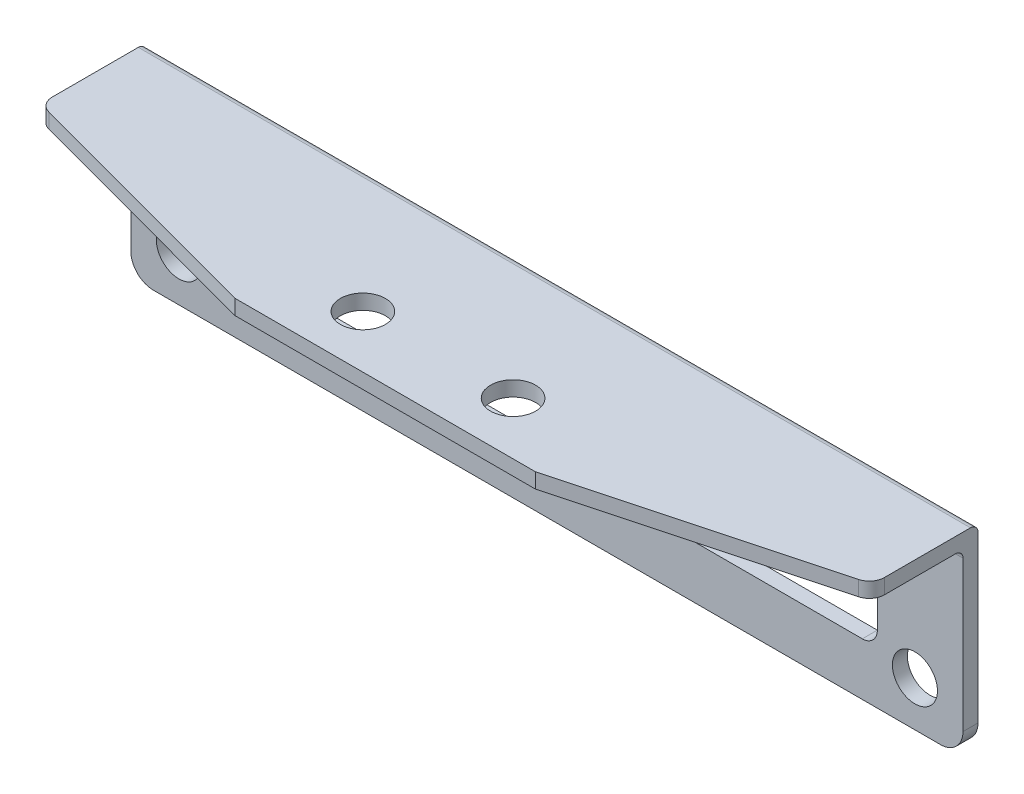
ISO-10303-21;
HEADER;
FILE_DESCRIPTION(('STEP AP214'),'2;1');
FILE_NAME('part.step','',(''),(''),'','','');
FILE_SCHEMA(('AUTOMOTIVE_DESIGN { 1 0 10303 214 1 1 1 1 }'));
ENDSEC;
DATA;
#1=APPLICATION_CONTEXT('core data for automotive mechanical design processes');
#2=APPLICATION_PROTOCOL_DEFINITION('international standard','automotive_design',2000,#1);
#3=PRODUCT_CONTEXT('',#1,'mechanical');
#4=PRODUCT('Part','Part','',(#3));
#5=PRODUCT_RELATED_PRODUCT_CATEGORY('part','',(#4));
#6=PRODUCT_DEFINITION_FORMATION('','',#4);
#7=PRODUCT_DEFINITION_CONTEXT('part definition',#1,'design');
#8=PRODUCT_DEFINITION('design','',#6,#7);
#9=PRODUCT_DEFINITION_SHAPE('','',#8);
#10=(LENGTH_UNIT() NAMED_UNIT(*) SI_UNIT(.MILLI.,.METRE.));
#11=(NAMED_UNIT(*) PLANE_ANGLE_UNIT() SI_UNIT($,.RADIAN.));
#12=(NAMED_UNIT(*) SI_UNIT($,.STERADIAN.) SOLID_ANGLE_UNIT());
#13=UNCERTAINTY_MEASURE_WITH_UNIT(LENGTH_MEASURE(1.E-05),#10,'distance_accuracy_value','');
#14=(GEOMETRIC_REPRESENTATION_CONTEXT(3) GLOBAL_UNCERTAINTY_ASSIGNED_CONTEXT((#13)) GLOBAL_UNIT_ASSIGNED_CONTEXT((#10,
#11,#12)) REPRESENTATION_CONTEXT('',''));
#15=CARTESIAN_POINT('',(0.,0.,0.));
#16=DIRECTION('',(0.,0.,1.));
#17=DIRECTION('',(1.,0.,0.));
#18=AXIS2_PLACEMENT_3D('',#15,#16,#17);
#19=CARTESIAN_POINT('',(0.,0.,1.));
#20=DIRECTION('',(0.,0.,1.));
#21=DIRECTION('',(1.,0.,0.));
#22=AXIS2_PLACEMENT_3D('',#19,#20,#21);
#23=PLANE('',#22);
#24=DIRECTION('',(1.,0.,0.));
#25=VECTOR('',#24,1.);
#26=CARTESIAN_POINT('',(-27.7,0.,1.));
#27=LINE('',#26,#25);
#28=CARTESIAN_POINT('',(-26.2,0.,1.));
#29=VERTEX_POINT('',#28);
#30=CARTESIAN_POINT('',(26.2,0.,1.));
#31=VERTEX_POINT('',#30);
#32=EDGE_CURVE('E251',#29,#31,#27,.T.);
#33=ORIENTED_EDGE('',*,*,#32,.T.);
#34=CARTESIAN_POINT('',(26.2,1.5,1.));
#35=DIRECTION('',(0.,0.,1.));
#36=DIRECTION('',(1.,0.,0.));
#37=AXIS2_PLACEMENT_3D('',#34,#35,#36);
#38=CIRCLE('',#37,1.5);
#39=CARTESIAN_POINT('',(27.7,1.5,1.));
#40=VERTEX_POINT('',#39);
#41=EDGE_CURVE('E366',#31,#40,#38,.T.);
#42=ORIENTED_EDGE('',*,*,#41,.T.);
#43=DIRECTION('',(0.,1.,0.));
#44=VECTOR('',#43,1.);
#45=CARTESIAN_POINT('',(27.7,0.,1.));
#46=LINE('',#45,#44);
#47=CARTESIAN_POINT('',(27.7,11.5,1.));
#48=VERTEX_POINT('',#47);
#49=EDGE_CURVE('E317',#40,#48,#46,.T.);
#50=ORIENTED_EDGE('',*,*,#49,.T.);
#51=DIRECTION('',(1.,0.,0.));
#52=VECTOR('',#51,1.);
#53=CARTESIAN_POINT('',(0.,11.5,1.));
#54=LINE('',#53,#52);
#55=CARTESIAN_POINT('',(-27.7,11.5,1.));
#56=VERTEX_POINT('',#55);
#57=EDGE_CURVE('E272',#48,#56,#54,.F.);
#58=ORIENTED_EDGE('',*,*,#57,.T.);
#59=DIRECTION('',(0.,-1.,0.));
#60=VECTOR('',#59,1.);
#61=CARTESIAN_POINT('',(-27.7,13.,1.));
#62=LINE('',#61,#60);
#63=CARTESIAN_POINT('',(-27.7,1.5,1.));
#64=VERTEX_POINT('',#63);
#65=EDGE_CURVE('E254',#56,#64,#62,.T.);
#66=ORIENTED_EDGE('',*,*,#65,.T.);
#67=CARTESIAN_POINT('',(-26.2,1.5,1.));
#68=DIRECTION('',(0.,0.,1.));
#69=DIRECTION('',(1.,0.,0.));
#70=AXIS2_PLACEMENT_3D('',#67,#68,#69);
#71=CIRCLE('',#70,1.5);
#72=EDGE_CURVE('E379',#64,#29,#71,.T.);
#73=ORIENTED_EDGE('',*,*,#72,.T.);
#74=EDGE_LOOP('',(#33,#42,#50,#58,#66,#73));
#75=FACE_BOUND('',#74,.T.);
#76=CARTESIAN_POINT('',(-24.5,3.,1.));
#77=DIRECTION('',(0.,0.,1.));
#78=DIRECTION('',(1.,0.,0.));
#79=AXIS2_PLACEMENT_3D('',#76,#77,#78);
#80=CIRCLE('',#79,1.5);
#81=CARTESIAN_POINT('',(-23.,3.,1.));
#82=VERTEX_POINT('',#81);
#83=EDGE_CURVE('E219',#82,#82,#80,.T.);
#84=ORIENTED_EDGE('',*,*,#83,.F.);
#85=EDGE_LOOP('',(#84));
#86=FACE_BOUND('',#85,.T.);
#87=DIRECTION('',(-1.,0.,0.));
#88=VECTOR('',#87,1.);
#89=CARTESIAN_POINT('',(-22.,8.3,1.));
#90=LINE('',#89,#88);
#91=CARTESIAN_POINT('',(21.,8.3,1.));
#92=VERTEX_POINT('',#91);
#93=CARTESIAN_POINT('',(-21.,8.3,1.));
#94=VERTEX_POINT('',#93);
#95=EDGE_CURVE('E228',#92,#94,#90,.T.);
#96=ORIENTED_EDGE('',*,*,#95,.F.);
#97=CARTESIAN_POINT('',(21.,7.3,1.));
#98=DIRECTION('',(0.,0.,1.));
#99=DIRECTION('',(1.,0.,0.));
#100=AXIS2_PLACEMENT_3D('',#97,#98,#99);
#101=CIRCLE('',#100,1.);
#102=CARTESIAN_POINT('',(22.,7.3,1.));
#103=VERTEX_POINT('',#102);
#104=EDGE_CURVE('E306',#92,#103,#101,.F.);
#105=ORIENTED_EDGE('',*,*,#104,.T.);
#106=DIRECTION('',(0.,1.,0.));
#107=VECTOR('',#106,1.);
#108=CARTESIAN_POINT('',(22.,8.3,1.));
#109=LINE('',#108,#107);
#110=CARTESIAN_POINT('',(22.,4.5,1.));
#111=VERTEX_POINT('',#110);
#112=EDGE_CURVE('E225',#111,#103,#109,.T.);
#113=ORIENTED_EDGE('',*,*,#112,.F.);
#114=CARTESIAN_POINT('',(21.,4.5,1.));
#115=DIRECTION('',(0.,0.,1.));
#116=DIRECTION('',(1.,0.,0.));
#117=AXIS2_PLACEMENT_3D('',#114,#115,#116);
#118=CIRCLE('',#117,1.);
#119=CARTESIAN_POINT('',(21.,3.5,1.));
#120=VERTEX_POINT('',#119);
#121=EDGE_CURVE('E302',#111,#120,#118,.F.);
#122=ORIENTED_EDGE('',*,*,#121,.T.);
#123=DIRECTION('',(1.,0.,0.));
#124=VECTOR('',#123,1.);
#125=CARTESIAN_POINT('',(-22.,3.5,1.));
#126=LINE('',#125,#124);
#127=CARTESIAN_POINT('',(-21.,3.5,1.));
#128=VERTEX_POINT('',#127);
#129=EDGE_CURVE('E235',#128,#120,#126,.T.);
#130=ORIENTED_EDGE('',*,*,#129,.F.);
#131=CARTESIAN_POINT('',(-21.,4.5,1.));
#132=DIRECTION('',(0.,0.,1.));
#133=DIRECTION('',(1.,0.,0.));
#134=AXIS2_PLACEMENT_3D('',#131,#132,#133);
#135=CIRCLE('',#134,1.);
#136=CARTESIAN_POINT('',(-22.,4.5,1.));
#137=VERTEX_POINT('',#136);
#138=EDGE_CURVE('E310',#128,#137,#135,.F.);
#139=ORIENTED_EDGE('',*,*,#138,.T.);
#140=DIRECTION('',(0.,-1.,0.));
#141=VECTOR('',#140,1.);
#142=CARTESIAN_POINT('',(-22.,8.3,1.));
#143=LINE('',#142,#141);
#144=CARTESIAN_POINT('',(-22.,7.3,1.));
#145=VERTEX_POINT('',#144);
#146=EDGE_CURVE('E232',#145,#137,#143,.T.);
#147=ORIENTED_EDGE('',*,*,#146,.F.);
#148=CARTESIAN_POINT('',(-21.,7.3,1.));
#149=DIRECTION('',(0.,0.,1.));
#150=DIRECTION('',(1.,0.,0.));
#151=AXIS2_PLACEMENT_3D('',#148,#149,#150);
#152=CIRCLE('',#151,1.);
#153=EDGE_CURVE('E314',#145,#94,#152,.F.);
#154=ORIENTED_EDGE('',*,*,#153,.T.);
#155=EDGE_LOOP('',(#96,#105,#113,#122,#130,#139,#147,#154));
#156=FACE_BOUND('',#155,.T.);
#157=CARTESIAN_POINT('',(24.5,3.,1.));
#158=DIRECTION('',(0.,0.,1.));
#159=DIRECTION('',(1.,0.,0.));
#160=AXIS2_PLACEMENT_3D('',#157,#158,#159);
#161=CIRCLE('',#160,1.5);
#162=CARTESIAN_POINT('',(26.,3.,1.));
#163=VERTEX_POINT('',#162);
#164=EDGE_CURVE('E212',#163,#163,#161,.T.);
#165=ORIENTED_EDGE('',*,*,#164,.F.);
#166=EDGE_LOOP('',(#165));
#167=FACE_BOUND('',#166,.T.);
#168=ADVANCED_FACE('F34',(#75,#86,#156,#167),#23,.T.);
#169=CARTESIAN_POINT('',(0.,0.,0.));
#170=DIRECTION('',(0.,0.,1.));
#171=DIRECTION('',(1.,0.,0.));
#172=AXIS2_PLACEMENT_3D('',#169,#170,#171);
#173=PLANE('',#172);
#174=CARTESIAN_POINT('',(-24.5,3.,0.));
#175=DIRECTION('',(0.,0.,1.));
#176=DIRECTION('',(1.,0.,0.));
#177=AXIS2_PLACEMENT_3D('',#174,#175,#176);
#178=CIRCLE('',#177,1.5);
#179=CARTESIAN_POINT('',(-23.,3.,0.));
#180=VERTEX_POINT('',#179);
#181=EDGE_CURVE('E215',#180,#180,#178,.T.);
#182=ORIENTED_EDGE('',*,*,#181,.T.);
#183=EDGE_LOOP('',(#182));
#184=FACE_BOUND('',#183,.T.);
#185=DIRECTION('',(0.,1.,0.));
#186=VECTOR('',#185,1.);
#187=CARTESIAN_POINT('',(27.7,0.,0.));
#188=LINE('',#187,#186);
#189=CARTESIAN_POINT('',(27.7,1.5,0.));
#190=VERTEX_POINT('',#189);
#191=CARTESIAN_POINT('',(27.7,12.5,0.));
#192=VERTEX_POINT('',#191);
#193=EDGE_CURVE('E258',#190,#192,#188,.T.);
#194=ORIENTED_EDGE('',*,*,#193,.F.);
#195=CARTESIAN_POINT('',(26.2,1.5,0.));
#196=DIRECTION('',(0.,0.,1.));
#197=DIRECTION('',(1.,0.,0.));
#198=AXIS2_PLACEMENT_3D('',#195,#196,#197);
#199=CIRCLE('',#198,1.5);
#200=CARTESIAN_POINT('',(26.2,0.,0.));
#201=VERTEX_POINT('',#200);
#202=EDGE_CURVE('E367',#190,#201,#199,.F.);
#203=ORIENTED_EDGE('',*,*,#202,.T.);
#204=DIRECTION('',(1.,0.,0.));
#205=VECTOR('',#204,1.);
#206=CARTESIAN_POINT('',(-27.7,0.,0.));
#207=LINE('',#206,#205);
#208=CARTESIAN_POINT('',(-26.2,0.,0.));
#209=VERTEX_POINT('',#208);
#210=EDGE_CURVE('E325',#209,#201,#207,.T.);
#211=ORIENTED_EDGE('',*,*,#210,.F.);
#212=CARTESIAN_POINT('',(-26.2,1.5,0.));
#213=DIRECTION('',(0.,0.,1.));
#214=DIRECTION('',(1.,0.,0.));
#215=AXIS2_PLACEMENT_3D('',#212,#213,#214);
#216=CIRCLE('',#215,1.5);
#217=CARTESIAN_POINT('',(-27.7,1.5,0.));
#218=VERTEX_POINT('',#217);
#219=EDGE_CURVE('E368',#209,#218,#216,.F.);
#220=ORIENTED_EDGE('',*,*,#219,.T.);
#221=DIRECTION('',(0.,-1.,0.));
#222=VECTOR('',#221,1.);
#223=CARTESIAN_POINT('',(-27.7,13.,0.));
#224=LINE('',#223,#222);
#225=CARTESIAN_POINT('',(-27.7,12.5,0.));
#226=VERTEX_POINT('',#225);
#227=EDGE_CURVE('E238',#226,#218,#224,.T.);
#228=ORIENTED_EDGE('',*,*,#227,.F.);
#229=DIRECTION('',(-1.,0.,0.));
#230=VECTOR('',#229,1.);
#231=CARTESIAN_POINT('',(0.,12.5,0.));
#232=LINE('',#231,#230);
#233=EDGE_CURVE('E263',#226,#192,#232,.F.);
#234=ORIENTED_EDGE('',*,*,#233,.T.);
#235=EDGE_LOOP('',(#194,#203,#211,#220,#228,#234));
#236=FACE_BOUND('',#235,.T.);
#237=DIRECTION('',(1.,0.,0.));
#238=VECTOR('',#237,1.);
#239=CARTESIAN_POINT('',(-22.,3.5,0.));
#240=LINE('',#239,#238);
#241=CARTESIAN_POINT('',(-21.,3.5,0.));
#242=VERTEX_POINT('',#241);
#243=CARTESIAN_POINT('',(21.,3.5,0.));
#244=VERTEX_POINT('',#243);
#245=EDGE_CURVE('E229',#242,#244,#240,.T.);
#246=ORIENTED_EDGE('',*,*,#245,.T.);
#247=CARTESIAN_POINT('',(21.,4.5,0.));
#248=DIRECTION('',(0.,0.,1.));
#249=DIRECTION('',(1.,0.,0.));
#250=AXIS2_PLACEMENT_3D('',#247,#248,#249);
#251=CIRCLE('',#250,1.);
#252=CARTESIAN_POINT('',(22.,4.5,0.));
#253=VERTEX_POINT('',#252);
#254=EDGE_CURVE('E300',#244,#253,#251,.T.);
#255=ORIENTED_EDGE('',*,*,#254,.T.);
#256=DIRECTION('',(0.,1.,0.));
#257=VECTOR('',#256,1.);
#258=CARTESIAN_POINT('',(22.,8.3,0.));
#259=LINE('',#258,#257);
#260=CARTESIAN_POINT('',(22.,7.3,0.));
#261=VERTEX_POINT('',#260);
#262=EDGE_CURVE('E222',#253,#261,#259,.T.);
#263=ORIENTED_EDGE('',*,*,#262,.T.);
#264=CARTESIAN_POINT('',(21.,7.3,0.));
#265=DIRECTION('',(0.,0.,1.));
#266=DIRECTION('',(1.,0.,0.));
#267=AXIS2_PLACEMENT_3D('',#264,#265,#266);
#268=CIRCLE('',#267,1.);
#269=CARTESIAN_POINT('',(21.,8.3,0.));
#270=VERTEX_POINT('',#269);
#271=EDGE_CURVE('E304',#261,#270,#268,.T.);
#272=ORIENTED_EDGE('',*,*,#271,.T.);
#273=DIRECTION('',(-1.,0.,0.));
#274=VECTOR('',#273,1.);
#275=CARTESIAN_POINT('',(-22.,8.3,0.));
#276=LINE('',#275,#274);
#277=CARTESIAN_POINT('',(-21.,8.3,0.));
#278=VERTEX_POINT('',#277);
#279=EDGE_CURVE('E241',#270,#278,#276,.T.);
#280=ORIENTED_EDGE('',*,*,#279,.T.);
#281=CARTESIAN_POINT('',(-21.,7.3,0.));
#282=DIRECTION('',(0.,0.,1.));
#283=DIRECTION('',(1.,0.,0.));
#284=AXIS2_PLACEMENT_3D('',#281,#282,#283);
#285=CIRCLE('',#284,1.);
#286=CARTESIAN_POINT('',(-22.,7.3,0.));
#287=VERTEX_POINT('',#286);
#288=EDGE_CURVE('E312',#278,#287,#285,.T.);
#289=ORIENTED_EDGE('',*,*,#288,.T.);
#290=DIRECTION('',(0.,-1.,0.));
#291=VECTOR('',#290,1.);
#292=CARTESIAN_POINT('',(-22.,8.3,0.));
#293=LINE('',#292,#291);
#294=CARTESIAN_POINT('',(-22.,4.5,0.));
#295=VERTEX_POINT('',#294);
#296=EDGE_CURVE('E244',#287,#295,#293,.T.);
#297=ORIENTED_EDGE('',*,*,#296,.T.);
#298=CARTESIAN_POINT('',(-21.,4.5,0.));
#299=DIRECTION('',(0.,0.,1.));
#300=DIRECTION('',(1.,0.,0.));
#301=AXIS2_PLACEMENT_3D('',#298,#299,#300);
#302=CIRCLE('',#301,1.);
#303=EDGE_CURVE('E308',#295,#242,#302,.T.);
#304=ORIENTED_EDGE('',*,*,#303,.T.);
#305=EDGE_LOOP('',(#246,#255,#263,#272,#280,#289,#297,#304));
#306=FACE_BOUND('',#305,.T.);
#307=CARTESIAN_POINT('',(24.5,3.,0.));
#308=DIRECTION('',(0.,0.,1.));
#309=DIRECTION('',(1.,0.,0.));
#310=AXIS2_PLACEMENT_3D('',#307,#308,#309);
#311=CIRCLE('',#310,1.5);
#312=CARTESIAN_POINT('',(26.,3.,0.));
#313=VERTEX_POINT('',#312);
#314=EDGE_CURVE('E216',#313,#313,#311,.T.);
#315=ORIENTED_EDGE('',*,*,#314,.T.);
#316=EDGE_LOOP('',(#315));
#317=FACE_BOUND('',#316,.T.);
#318=ADVANCED_FACE('F433',(#184,#236,#306,#317),#173,.F.);
#319=CARTESIAN_POINT('',(27.7,13.,1.));
#320=DIRECTION('',(0.,-1.,0.));
#321=DIRECTION('',(0.,0.,-1.));
#322=AXIS2_PLACEMENT_3D('',#319,#320,#321);
#323=PLANE('',#322);
#324=CARTESIAN_POINT('',(5.,13.,8.25));
#325=DIRECTION('',(0.,-1.,0.));
#326=DIRECTION('',(1.,0.,0.));
#327=AXIS2_PLACEMENT_3D('',#324,#325,#326);
#328=CIRCLE('',#327,1.5);
#329=CARTESIAN_POINT('',(6.5,13.,8.25));
#330=VERTEX_POINT('',#329);
#331=EDGE_CURVE('E398',#330,#330,#328,.T.);
#332=ORIENTED_EDGE('',*,*,#331,.T.);
#333=EDGE_LOOP('',(#332));
#334=FACE_BOUND('',#333,.T.);
#335=CARTESIAN_POINT('',(-5.,13.,8.25));
#336=DIRECTION('',(0.,-1.,0.));
#337=DIRECTION('',(1.,0.,0.));
#338=AXIS2_PLACEMENT_3D('',#335,#336,#337);
#339=CIRCLE('',#338,1.5);
#340=CARTESIAN_POINT('',(-3.5,13.,8.25));
#341=VERTEX_POINT('',#340);
#342=EDGE_CURVE('E198',#341,#341,#339,.T.);
#343=ORIENTED_EDGE('',*,*,#342,.T.);
#344=EDGE_LOOP('',(#343));
#345=FACE_BOUND('',#344,.T.);
#346=DIRECTION('',(0.,0.,-1.));
#347=VECTOR('',#346,1.);
#348=CARTESIAN_POINT('',(-27.7,13.,1.));
#349=LINE('',#348,#347);
#350=CARTESIAN_POINT('',(-27.7,13.,6.23297859063165));
#351=VERTEX_POINT('',#350);
#352=CARTESIAN_POINT('',(-27.7,13.,0.5));
#353=VERTEX_POINT('',#352);
#354=EDGE_CURVE('E330',#351,#353,#349,.T.);
#355=ORIENTED_EDGE('',*,*,#354,.F.);
#356=CARTESIAN_POINT('',(-26.7,13.,6.23297859063165));
#357=DIRECTION('',(0.,-1.,0.));
#358=DIRECTION('',(0.,0.,-1.));
#359=AXIS2_PLACEMENT_3D('',#356,#357,#358);
#360=CIRCLE('',#359,1.);
#361=CARTESIAN_POINT('',(-26.9591906417033,13.,7.19880477129432));
#362=VERTEX_POINT('',#361);
#363=EDGE_CURVE('E344',#351,#362,#360,.F.);
#364=ORIENTED_EDGE('',*,*,#363,.T.);
#365=DIRECTION('',(0.965826180662676,0.,0.259190641703261));
#366=VECTOR('',#365,1.);
#367=CARTESIAN_POINT('',(-10.,13.,11.75));
#368=LINE('',#367,#366);
#369=CARTESIAN_POINT('',(-10.,13.,11.75));
#370=VERTEX_POINT('',#369);
#371=EDGE_CURVE('E388',#362,#370,#368,.T.);
#372=ORIENTED_EDGE('',*,*,#371,.T.);
#373=DIRECTION('',(-1.,0.,0.));
#374=VECTOR('',#373,1.);
#375=CARTESIAN_POINT('',(27.7,13.,11.75));
#376=LINE('',#375,#374);
#377=CARTESIAN_POINT('',(10.,13.,11.75));
#378=VERTEX_POINT('',#377);
#379=EDGE_CURVE('E205',#378,#370,#376,.T.);
#380=ORIENTED_EDGE('',*,*,#379,.F.);
#381=DIRECTION('',(0.965826180662676,0.,-0.259190641703261));
#382=VECTOR('',#381,1.);
#383=CARTESIAN_POINT('',(10.,13.,11.75));
#384=LINE('',#383,#382);
#385=CARTESIAN_POINT('',(26.9591906417033,13.,7.19880477129433));
#386=VERTEX_POINT('',#385);
#387=EDGE_CURVE('E184',#378,#386,#384,.T.);
#388=ORIENTED_EDGE('',*,*,#387,.T.);
#389=CARTESIAN_POINT('',(26.7,13.,6.23297859063165));
#390=DIRECTION('',(0.,-1.,0.));
#391=DIRECTION('',(0.,0.,-1.));
#392=AXIS2_PLACEMENT_3D('',#389,#390,#391);
#393=CIRCLE('',#392,1.);
#394=CARTESIAN_POINT('',(27.7,13.,6.23297859063165));
#395=VERTEX_POINT('',#394);
#396=EDGE_CURVE('E54',#386,#395,#393,.F.);
#397=ORIENTED_EDGE('',*,*,#396,.T.);
#398=DIRECTION('',(0.,0.,-1.));
#399=VECTOR('',#398,1.);
#400=CARTESIAN_POINT('',(27.7,13.,1.));
#401=LINE('',#400,#399);
#402=CARTESIAN_POINT('',(27.7,13.,0.5));
#403=VERTEX_POINT('',#402);
#404=EDGE_CURVE('E319',#395,#403,#401,.T.);
#405=ORIENTED_EDGE('',*,*,#404,.T.);
#406=DIRECTION('',(-1.,0.,0.));
#407=VECTOR('',#406,1.);
#408=CARTESIAN_POINT('',(27.7,13.,0.5));
#409=LINE('',#408,#407);
#410=EDGE_CURVE('E259',#403,#353,#409,.T.);
#411=ORIENTED_EDGE('',*,*,#410,.T.);
#412=EDGE_LOOP('',(#355,#364,#372,#380,#388,#397,#405,#411));
#413=FACE_BOUND('',#412,.T.);
#414=ADVANCED_FACE('F407',(#334,#345,#413),#323,.F.);
#415=CARTESIAN_POINT('',(-27.7,13.,1.));
#416=DIRECTION('',(1.,0.,0.));
#417=DIRECTION('',(0.,1.,0.));
#418=AXIS2_PLACEMENT_3D('',#415,#416,#417);
#419=PLANE('',#418);
#420=DIRECTION('',(0.,0.,-1.));
#421=VECTOR('',#420,1.);
#422=CARTESIAN_POINT('',(-27.7,12.,11.75));
#423=LINE('',#422,#421);
#424=CARTESIAN_POINT('',(-27.7,12.,6.23297859063165));
#425=VERTEX_POINT('',#424);
#426=CARTESIAN_POINT('',(-27.7,12.,1.5));
#427=VERTEX_POINT('',#426);
#428=EDGE_CURVE('E207',#425,#427,#423,.T.);
#429=ORIENTED_EDGE('',*,*,#428,.F.);
#430=DIRECTION('',(0.,-1.,0.));
#431=VECTOR('',#430,1.);
#432=CARTESIAN_POINT('',(-27.7,13.,6.23297859063165));
#433=LINE('',#432,#431);
#434=EDGE_CURVE('E341',#425,#351,#433,.F.);
#435=ORIENTED_EDGE('',*,*,#434,.T.);
#436=ORIENTED_EDGE('',*,*,#354,.T.);
#437=CARTESIAN_POINT('',(-27.7,12.5,0.5));
#438=DIRECTION('',(1.,0.,0.));
#439=DIRECTION('',(0.,1.,0.));
#440=AXIS2_PLACEMENT_3D('',#437,#438,#439);
#441=CIRCLE('',#440,0.5);
#442=EDGE_CURVE('E261',#353,#226,#441,.F.);
#443=ORIENTED_EDGE('',*,*,#442,.T.);
#444=ORIENTED_EDGE('',*,*,#227,.T.);
#445=DIRECTION('',(0.,0.,-1.));
#446=VECTOR('',#445,1.);
#447=CARTESIAN_POINT('',(-27.7,1.5,1.));
#448=LINE('',#447,#446);
#449=EDGE_CURVE('E382',#218,#64,#448,.F.);
#450=ORIENTED_EDGE('',*,*,#449,.T.);
#451=ORIENTED_EDGE('',*,*,#65,.F.);
#452=CARTESIAN_POINT('',(-27.7,11.5,1.5));
#453=DIRECTION('',(1.,0.,0.));
#454=DIRECTION('',(0.,1.,0.));
#455=AXIS2_PLACEMENT_3D('',#452,#453,#454);
#456=CIRCLE('',#455,0.5);
#457=EDGE_CURVE('E277',#56,#427,#456,.T.);
#458=ORIENTED_EDGE('',*,*,#457,.T.);
#459=EDGE_LOOP('',(#429,#435,#436,#443,#444,#450,#451,#458));
#460=FACE_BOUND('',#459,.T.);
#461=ADVANCED_FACE('F451',(#460),#419,.F.);
#462=CARTESIAN_POINT('',(-27.7,0.,1.));
#463=DIRECTION('',(0.,1.,0.));
#464=DIRECTION('',(0.,0.,1.));
#465=AXIS2_PLACEMENT_3D('',#462,#463,#464);
#466=PLANE('',#465);
#467=ORIENTED_EDGE('',*,*,#210,.T.);
#468=DIRECTION('',(0.,0.,-1.));
#469=VECTOR('',#468,1.);
#470=CARTESIAN_POINT('',(26.2,0.,1.));
#471=LINE('',#470,#469);
#472=EDGE_CURVE('E377',#201,#31,#471,.F.);
#473=ORIENTED_EDGE('',*,*,#472,.T.);
#474=ORIENTED_EDGE('',*,*,#32,.F.);
#475=DIRECTION('',(0.,0.,-1.));
#476=VECTOR('',#475,1.);
#477=CARTESIAN_POINT('',(-26.2,0.,1.));
#478=LINE('',#477,#476);
#479=EDGE_CURVE('E372',#29,#209,#478,.T.);
#480=ORIENTED_EDGE('',*,*,#479,.T.);
#481=EDGE_LOOP('',(#467,#473,#474,#480));
#482=FACE_BOUND('',#481,.T.);
#483=ADVANCED_FACE('F448',(#482),#466,.F.);
#484=CARTESIAN_POINT('',(27.7,0.,1.));
#485=DIRECTION('',(-1.,0.,0.));
#486=DIRECTION('',(0.,-1.,0.));
#487=AXIS2_PLACEMENT_3D('',#484,#485,#486);
#488=PLANE('',#487);
#489=ORIENTED_EDGE('',*,*,#404,.F.);
#490=DIRECTION('',(0.,-1.,0.));
#491=VECTOR('',#490,1.);
#492=CARTESIAN_POINT('',(27.7,0.,6.23297859063165));
#493=LINE('',#492,#491);
#494=CARTESIAN_POINT('',(27.7,12.,6.23297859063165));
#495=VERTEX_POINT('',#494);
#496=EDGE_CURVE('E42',#395,#495,#493,.T.);
#497=ORIENTED_EDGE('',*,*,#496,.T.);
#498=DIRECTION('',(0.,0.,-1.));
#499=VECTOR('',#498,1.);
#500=CARTESIAN_POINT('',(27.7,12.,11.75));
#501=LINE('',#500,#499);
#502=CARTESIAN_POINT('',(27.7,12.,1.5));
#503=VERTEX_POINT('',#502);
#504=EDGE_CURVE('E204',#495,#503,#501,.T.);
#505=ORIENTED_EDGE('',*,*,#504,.T.);
#506=CARTESIAN_POINT('',(27.7,11.5,1.5));
#507=DIRECTION('',(-1.,0.,0.));
#508=DIRECTION('',(0.,-1.,0.));
#509=AXIS2_PLACEMENT_3D('',#506,#507,#508);
#510=CIRCLE('',#509,0.5);
#511=EDGE_CURVE('E274',#503,#48,#510,.T.);
#512=ORIENTED_EDGE('',*,*,#511,.T.);
#513=ORIENTED_EDGE('',*,*,#49,.F.);
#514=DIRECTION('',(0.,0.,-1.));
#515=VECTOR('',#514,1.);
#516=CARTESIAN_POINT('',(27.7,1.5,1.));
#517=LINE('',#516,#515);
#518=EDGE_CURVE('E316',#40,#190,#517,.T.);
#519=ORIENTED_EDGE('',*,*,#518,.T.);
#520=ORIENTED_EDGE('',*,*,#193,.T.);
#521=CARTESIAN_POINT('',(27.7,12.5,0.5));
#522=DIRECTION('',(-1.,0.,0.));
#523=DIRECTION('',(0.,-1.,0.));
#524=AXIS2_PLACEMENT_3D('',#521,#522,#523);
#525=CIRCLE('',#524,0.5);
#526=EDGE_CURVE('E266',#192,#403,#525,.F.);
#527=ORIENTED_EDGE('',*,*,#526,.T.);
#528=EDGE_LOOP('',(#489,#497,#505,#512,#513,#519,#520,#527));
#529=FACE_BOUND('',#528,.T.);
#530=ADVANCED_FACE('F348',(#529),#488,.F.);
#531=CARTESIAN_POINT('',(22.,8.3,1.));
#532=DIRECTION('',(-1.,0.,0.));
#533=DIRECTION('',(0.,0.,1.));
#534=AXIS2_PLACEMENT_3D('',#531,#532,#533);
#535=PLANE('',#534);
#536=ORIENTED_EDGE('',*,*,#262,.F.);
#537=DIRECTION('',(0.,0.,-1.));
#538=VECTOR('',#537,1.);
#539=CARTESIAN_POINT('',(22.,4.5,1.));
#540=LINE('',#539,#538);
#541=EDGE_CURVE('E288',#253,#111,#540,.F.);
#542=ORIENTED_EDGE('',*,*,#541,.T.);
#543=ORIENTED_EDGE('',*,*,#112,.T.);
#544=DIRECTION('',(0.,0.,-1.));
#545=VECTOR('',#544,1.);
#546=CARTESIAN_POINT('',(22.,7.3,0.));
#547=LINE('',#546,#545);
#548=EDGE_CURVE('E285',#103,#261,#547,.T.);
#549=ORIENTED_EDGE('',*,*,#548,.T.);
#550=EDGE_LOOP('',(#536,#542,#543,#549));
#551=FACE_BOUND('',#550,.T.);
#552=ADVANCED_FACE('F443',(#551),#535,.T.);
#553=CARTESIAN_POINT('',(-22.,8.3,1.));
#554=DIRECTION('',(0.,-1.,0.));
#555=DIRECTION('',(0.,0.,-1.));
#556=AXIS2_PLACEMENT_3D('',#553,#554,#555);
#557=PLANE('',#556);
#558=ORIENTED_EDGE('',*,*,#279,.F.);
#559=DIRECTION('',(0.,0.,-1.));
#560=VECTOR('',#559,1.);
#561=CARTESIAN_POINT('',(21.,8.3,1.));
#562=LINE('',#561,#560);
#563=EDGE_CURVE('E293',#270,#92,#562,.F.);
#564=ORIENTED_EDGE('',*,*,#563,.T.);
#565=ORIENTED_EDGE('',*,*,#95,.T.);
#566=DIRECTION('',(0.,0.,-1.));
#567=VECTOR('',#566,1.);
#568=CARTESIAN_POINT('',(-21.,8.3,0.));
#569=LINE('',#568,#567);
#570=EDGE_CURVE('E290',#94,#278,#569,.T.);
#571=ORIENTED_EDGE('',*,*,#570,.T.);
#572=EDGE_LOOP('',(#558,#564,#565,#571));
#573=FACE_BOUND('',#572,.T.);
#574=ADVANCED_FACE('F523',(#573),#557,.T.);
#575=CARTESIAN_POINT('',(-22.,8.3,1.));
#576=DIRECTION('',(1.,0.,0.));
#577=DIRECTION('',(0.,1.,0.));
#578=AXIS2_PLACEMENT_3D('',#575,#576,#577);
#579=PLANE('',#578);
#580=ORIENTED_EDGE('',*,*,#146,.T.);
#581=DIRECTION('',(0.,0.,-1.));
#582=VECTOR('',#581,1.);
#583=CARTESIAN_POINT('',(-22.,4.5,0.));
#584=LINE('',#583,#582);
#585=EDGE_CURVE('E297',#137,#295,#584,.T.);
#586=ORIENTED_EDGE('',*,*,#585,.T.);
#587=ORIENTED_EDGE('',*,*,#296,.F.);
#588=DIRECTION('',(0.,0.,-1.));
#589=VECTOR('',#588,1.);
#590=CARTESIAN_POINT('',(-22.,7.3,1.));
#591=LINE('',#590,#589);
#592=EDGE_CURVE('E295',#287,#145,#591,.F.);
#593=ORIENTED_EDGE('',*,*,#592,.T.);
#594=EDGE_LOOP('',(#580,#586,#587,#593));
#595=FACE_BOUND('',#594,.T.);
#596=ADVANCED_FACE('F520',(#595),#579,.T.);
#597=CARTESIAN_POINT('',(-22.,3.5,1.));
#598=DIRECTION('',(0.,1.,0.));
#599=DIRECTION('',(-1.,0.,0.));
#600=AXIS2_PLACEMENT_3D('',#597,#598,#599);
#601=PLANE('',#600);
#602=ORIENTED_EDGE('',*,*,#129,.T.);
#603=DIRECTION('',(0.,0.,-1.));
#604=VECTOR('',#603,1.);
#605=CARTESIAN_POINT('',(21.,3.5,0.));
#606=LINE('',#605,#604);
#607=EDGE_CURVE('E282',#120,#244,#606,.T.);
#608=ORIENTED_EDGE('',*,*,#607,.T.);
#609=ORIENTED_EDGE('',*,*,#245,.F.);
#610=DIRECTION('',(0.,0.,-1.));
#611=VECTOR('',#610,1.);
#612=CARTESIAN_POINT('',(-21.,3.5,1.));
#613=LINE('',#612,#611);
#614=EDGE_CURVE('E280',#242,#128,#613,.F.);
#615=ORIENTED_EDGE('',*,*,#614,.T.);
#616=EDGE_LOOP('',(#602,#608,#609,#615));
#617=FACE_BOUND('',#616,.T.);
#618=ADVANCED_FACE('F513',(#617),#601,.T.);
#619=CARTESIAN_POINT('',(-24.5,3.,1.));
#620=DIRECTION('',(0.,0.,-1.));
#621=DIRECTION('',(-1.,0.,0.));
#622=AXIS2_PLACEMENT_3D('',#619,#620,#621);
#623=CYLINDRICAL_SURFACE('',#622,1.5);
#624=ORIENTED_EDGE('',*,*,#83,.T.);
#625=EDGE_LOOP('',(#624));
#626=FACE_BOUND('',#625,.T.);
#627=ORIENTED_EDGE('',*,*,#181,.F.);
#628=EDGE_LOOP('',(#627));
#629=FACE_BOUND('',#628,.T.);
#630=ADVANCED_FACE('F507',(#626,#629),#623,.F.);
#631=CARTESIAN_POINT('',(24.5,3.,1.));
#632=DIRECTION('',(0.,0.,-1.));
#633=DIRECTION('',(-1.,0.,0.));
#634=AXIS2_PLACEMENT_3D('',#631,#632,#633);
#635=CYLINDRICAL_SURFACE('',#634,1.5);
#636=ORIENTED_EDGE('',*,*,#164,.T.);
#637=EDGE_LOOP('',(#636));
#638=FACE_BOUND('',#637,.T.);
#639=ORIENTED_EDGE('',*,*,#314,.F.);
#640=EDGE_LOOP('',(#639));
#641=FACE_BOUND('',#640,.T.);
#642=ADVANCED_FACE('F420',(#638,#641),#635,.F.);
#643=CARTESIAN_POINT('',(27.7,12.,11.75));
#644=DIRECTION('',(0.,1.,0.));
#645=DIRECTION('',(-1.,0.,0.));
#646=AXIS2_PLACEMENT_3D('',#643,#644,#645);
#647=PLANE('',#646);
#648=CARTESIAN_POINT('',(5.,12.,8.25));
#649=DIRECTION('',(0.,-1.,0.));
#650=DIRECTION('',(1.,0.,0.));
#651=AXIS2_PLACEMENT_3D('',#648,#649,#650);
#652=CIRCLE('',#651,1.5);
#653=CARTESIAN_POINT('',(6.5,12.,8.25));
#654=VERTEX_POINT('',#653);
#655=EDGE_CURVE('E401',#654,#654,#652,.T.);
#656=ORIENTED_EDGE('',*,*,#655,.F.);
#657=EDGE_LOOP('',(#656));
#658=FACE_BOUND('',#657,.T.);
#659=CARTESIAN_POINT('',(-5.,12.,8.25));
#660=DIRECTION('',(0.,-1.,0.));
#661=DIRECTION('',(1.,0.,0.));
#662=AXIS2_PLACEMENT_3D('',#659,#660,#661);
#663=CIRCLE('',#662,1.5);
#664=CARTESIAN_POINT('',(-3.5,12.,8.25));
#665=VERTEX_POINT('',#664);
#666=EDGE_CURVE('E395',#665,#665,#663,.T.);
#667=ORIENTED_EDGE('',*,*,#666,.F.);
#668=EDGE_LOOP('',(#667));
#669=FACE_BOUND('',#668,.T.);
#670=DIRECTION('',(0.965826180662676,0.,0.259190641703261));
#671=VECTOR('',#670,1.);
#672=CARTESIAN_POINT('',(-10.,12.,11.75));
#673=LINE('',#672,#671);
#674=CARTESIAN_POINT('',(-26.9591906417033,12.,7.19880477129432));
#675=VERTEX_POINT('',#674);
#676=CARTESIAN_POINT('',(-10.,12.,11.75));
#677=VERTEX_POINT('',#676);
#678=EDGE_CURVE('E189',#675,#677,#673,.T.);
#679=ORIENTED_EDGE('',*,*,#678,.F.);
#680=CARTESIAN_POINT('',(-26.7,12.,6.23297859063165));
#681=DIRECTION('',(0.,1.,0.));
#682=DIRECTION('',(-1.,0.,0.));
#683=AXIS2_PLACEMENT_3D('',#680,#681,#682);
#684=CIRCLE('',#683,1.);
#685=EDGE_CURVE('E338',#675,#425,#684,.F.);
#686=ORIENTED_EDGE('',*,*,#685,.T.);
#687=ORIENTED_EDGE('',*,*,#428,.T.);
#688=DIRECTION('',(1.,0.,0.));
#689=VECTOR('',#688,1.);
#690=CARTESIAN_POINT('',(27.7,12.,1.5));
#691=LINE('',#690,#689);
#692=EDGE_CURVE('E269',#427,#503,#691,.T.);
#693=ORIENTED_EDGE('',*,*,#692,.T.);
#694=ORIENTED_EDGE('',*,*,#504,.F.);
#695=CARTESIAN_POINT('',(26.7,12.,6.23297859063165));
#696=DIRECTION('',(0.,1.,0.));
#697=DIRECTION('',(-1.,0.,0.));
#698=AXIS2_PLACEMENT_3D('',#695,#696,#697);
#699=CIRCLE('',#698,1.);
#700=CARTESIAN_POINT('',(26.9591906417033,12.,7.19880477129433));
#701=VERTEX_POINT('',#700);
#702=EDGE_CURVE('E197',#495,#701,#699,.F.);
#703=ORIENTED_EDGE('',*,*,#702,.T.);
#704=DIRECTION('',(0.965826180662676,0.,-0.259190641703261));
#705=VECTOR('',#704,1.);
#706=CARTESIAN_POINT('',(10.,12.,11.75));
#707=LINE('',#706,#705);
#708=CARTESIAN_POINT('',(10.,12.,11.75));
#709=VERTEX_POINT('',#708);
#710=EDGE_CURVE('E183',#709,#701,#707,.T.);
#711=ORIENTED_EDGE('',*,*,#710,.F.);
#712=DIRECTION('',(1.,0.,0.));
#713=VECTOR('',#712,1.);
#714=CARTESIAN_POINT('',(27.7,12.,11.75));
#715=LINE('',#714,#713);
#716=EDGE_CURVE('E195',#677,#709,#715,.T.);
#717=ORIENTED_EDGE('',*,*,#716,.F.);
#718=EDGE_LOOP('',(#679,#686,#687,#693,#694,#703,#711,#717));
#719=FACE_BOUND('',#718,.T.);
#720=ADVANCED_FACE('F194',(#658,#669,#719),#647,.F.);
#721=CARTESIAN_POINT('',(0.,0.,11.75));
#722=DIRECTION('',(0.,0.,-1.));
#723=DIRECTION('',(-1.,0.,0.));
#724=AXIS2_PLACEMENT_3D('',#721,#722,#723);
#725=PLANE('',#724);
#726=ORIENTED_EDGE('',*,*,#716,.T.);
#727=DIRECTION('',(0.,-1.,0.));
#728=VECTOR('',#727,1.);
#729=CARTESIAN_POINT('',(10.,13.,11.75));
#730=LINE('',#729,#728);
#731=EDGE_CURVE('E180',#378,#709,#730,.T.);
#732=ORIENTED_EDGE('',*,*,#731,.F.);
#733=ORIENTED_EDGE('',*,*,#379,.T.);
#734=DIRECTION('',(0.,-1.,0.));
#735=VECTOR('',#734,1.);
#736=CARTESIAN_POINT('',(-10.,13.,11.75));
#737=LINE('',#736,#735);
#738=EDGE_CURVE('E203',#370,#677,#737,.T.);
#739=ORIENTED_EDGE('',*,*,#738,.T.);
#740=EDGE_LOOP('',(#726,#732,#733,#739));
#741=FACE_BOUND('',#740,.T.);
#742=ADVANCED_FACE('F201',(#741),#725,.F.);
#743=CARTESIAN_POINT('',(-10.,13.,11.75));
#744=DIRECTION('',(0.259190641703261,0.,-0.965826180662676));
#745=DIRECTION('',(-0.965826180662676,0.,-0.259190641703261));
#746=AXIS2_PLACEMENT_3D('',#743,#744,#745);
#747=PLANE('',#746);
#748=ORIENTED_EDGE('',*,*,#371,.F.);
#749=DIRECTION('',(0.,-1.,0.));
#750=VECTOR('',#749,1.);
#751=CARTESIAN_POINT('',(-26.9591906417033,13.,7.19880477129432));
#752=LINE('',#751,#750);
#753=EDGE_CURVE('E339',#362,#675,#752,.T.);
#754=ORIENTED_EDGE('',*,*,#753,.T.);
#755=ORIENTED_EDGE('',*,*,#678,.T.);
#756=ORIENTED_EDGE('',*,*,#738,.F.);
#757=EDGE_LOOP('',(#748,#754,#755,#756));
#758=FACE_BOUND('',#757,.T.);
#759=ADVANCED_FACE('F387',(#758),#747,.F.);
#760=CARTESIAN_POINT('',(10.,13.,11.75));
#761=DIRECTION('',(-0.259190641703261,0.,-0.965826180662676));
#762=DIRECTION('',(-0.965826180662676,0.,0.259190641703261));
#763=AXIS2_PLACEMENT_3D('',#760,#761,#762);
#764=PLANE('',#763);
#765=ORIENTED_EDGE('',*,*,#710,.T.);
#766=DIRECTION('',(0.,-1.,0.));
#767=VECTOR('',#766,1.);
#768=CARTESIAN_POINT('',(26.9591906417033,13.,7.19880477129432));
#769=LINE('',#768,#767);
#770=EDGE_CURVE('E11',#701,#386,#769,.F.);
#771=ORIENTED_EDGE('',*,*,#770,.T.);
#772=ORIENTED_EDGE('',*,*,#387,.F.);
#773=ORIENTED_EDGE('',*,*,#731,.T.);
#774=EDGE_LOOP('',(#765,#771,#772,#773));
#775=FACE_BOUND('',#774,.T.);
#776=ADVANCED_FACE('F182',(#775),#764,.F.);
#777=CARTESIAN_POINT('',(-5.,13.,8.25));
#778=DIRECTION('',(0.,-1.,0.));
#779=DIRECTION('',(1.,0.,0.));
#780=AXIS2_PLACEMENT_3D('',#777,#778,#779);
#781=CYLINDRICAL_SURFACE('',#780,1.5);
#782=ORIENTED_EDGE('',*,*,#342,.F.);
#783=EDGE_LOOP('',(#782));
#784=FACE_BOUND('',#783,.T.);
#785=ORIENTED_EDGE('',*,*,#666,.T.);
#786=EDGE_LOOP('',(#785));
#787=FACE_BOUND('',#786,.T.);
#788=ADVANCED_FACE('F414',(#784,#787),#781,.F.);
#789=CARTESIAN_POINT('',(5.,13.,8.25));
#790=DIRECTION('',(0.,-1.,0.));
#791=DIRECTION('',(1.,0.,0.));
#792=AXIS2_PLACEMENT_3D('',#789,#790,#791);
#793=CYLINDRICAL_SURFACE('',#792,1.5);
#794=ORIENTED_EDGE('',*,*,#331,.F.);
#795=EDGE_LOOP('',(#794));
#796=FACE_BOUND('',#795,.T.);
#797=ORIENTED_EDGE('',*,*,#655,.T.);
#798=EDGE_LOOP('',(#797));
#799=FACE_BOUND('',#798,.T.);
#800=ADVANCED_FACE('F410',(#796,#799),#793,.F.);
#801=CARTESIAN_POINT('',(27.7,12.5,0.5));
#802=DIRECTION('',(-1.,0.,0.));
#803=DIRECTION('',(0.,0.,1.));
#804=AXIS2_PLACEMENT_3D('',#801,#802,#803);
#805=CYLINDRICAL_SURFACE('',#804,0.5);
#806=ORIENTED_EDGE('',*,*,#526,.F.);
#807=ORIENTED_EDGE('',*,*,#233,.F.);
#808=ORIENTED_EDGE('',*,*,#442,.F.);
#809=ORIENTED_EDGE('',*,*,#410,.F.);
#810=EDGE_LOOP('',(#806,#807,#808,#809));
#811=FACE_BOUND('',#810,.T.);
#812=ADVANCED_FACE('F413',(#811),#805,.T.);
#813=CARTESIAN_POINT('',(27.7,11.5,1.5));
#814=DIRECTION('',(1.,0.,0.));
#815=DIRECTION('',(0.,1.,0.));
#816=AXIS2_PLACEMENT_3D('',#813,#814,#815);
#817=CYLINDRICAL_SURFACE('',#816,0.5);
#818=ORIENTED_EDGE('',*,*,#457,.F.);
#819=ORIENTED_EDGE('',*,*,#57,.F.);
#820=ORIENTED_EDGE('',*,*,#511,.F.);
#821=ORIENTED_EDGE('',*,*,#692,.F.);
#822=EDGE_LOOP('',(#818,#819,#820,#821));
#823=FACE_BOUND('',#822,.T.);
#824=ADVANCED_FACE('F355',(#823),#817,.F.);
#825=CARTESIAN_POINT('',(21.,4.5,1.));
#826=DIRECTION('',(0.,0.,1.));
#827=DIRECTION('',(1.,0.,0.));
#828=AXIS2_PLACEMENT_3D('',#825,#826,#827);
#829=CYLINDRICAL_SURFACE('',#828,1.);
#830=ORIENTED_EDGE('',*,*,#121,.F.);
#831=ORIENTED_EDGE('',*,*,#541,.F.);
#832=ORIENTED_EDGE('',*,*,#254,.F.);
#833=ORIENTED_EDGE('',*,*,#607,.F.);
#834=EDGE_LOOP('',(#830,#831,#832,#833));
#835=FACE_BOUND('',#834,.T.);
#836=ADVANCED_FACE('F463',(#835),#829,.F.);
#837=CARTESIAN_POINT('',(21.,7.3,1.));
#838=DIRECTION('',(0.,0.,1.));
#839=DIRECTION('',(1.,0.,0.));
#840=AXIS2_PLACEMENT_3D('',#837,#838,#839);
#841=CYLINDRICAL_SURFACE('',#840,1.);
#842=ORIENTED_EDGE('',*,*,#104,.F.);
#843=ORIENTED_EDGE('',*,*,#563,.F.);
#844=ORIENTED_EDGE('',*,*,#271,.F.);
#845=ORIENTED_EDGE('',*,*,#548,.F.);
#846=EDGE_LOOP('',(#842,#843,#844,#845));
#847=FACE_BOUND('',#846,.T.);
#848=ADVANCED_FACE('F466',(#847),#841,.F.);
#849=CARTESIAN_POINT('',(-21.,4.5,1.));
#850=DIRECTION('',(0.,0.,1.));
#851=DIRECTION('',(1.,0.,0.));
#852=AXIS2_PLACEMENT_3D('',#849,#850,#851);
#853=CYLINDRICAL_SURFACE('',#852,1.);
#854=ORIENTED_EDGE('',*,*,#138,.F.);
#855=ORIENTED_EDGE('',*,*,#614,.F.);
#856=ORIENTED_EDGE('',*,*,#303,.F.);
#857=ORIENTED_EDGE('',*,*,#585,.F.);
#858=EDGE_LOOP('',(#854,#855,#856,#857));
#859=FACE_BOUND('',#858,.T.);
#860=ADVANCED_FACE('F470',(#859),#853,.F.);
#861=CARTESIAN_POINT('',(-21.,7.3,1.));
#862=DIRECTION('',(0.,0.,1.));
#863=DIRECTION('',(1.,0.,0.));
#864=AXIS2_PLACEMENT_3D('',#861,#862,#863);
#865=CYLINDRICAL_SURFACE('',#864,1.);
#866=ORIENTED_EDGE('',*,*,#153,.F.);
#867=ORIENTED_EDGE('',*,*,#592,.F.);
#868=ORIENTED_EDGE('',*,*,#288,.F.);
#869=ORIENTED_EDGE('',*,*,#570,.F.);
#870=EDGE_LOOP('',(#866,#867,#868,#869));
#871=FACE_BOUND('',#870,.T.);
#872=ADVANCED_FACE('F474',(#871),#865,.F.);
#873=CARTESIAN_POINT('',(26.2,1.5,1.));
#874=DIRECTION('',(0.,0.,-1.));
#875=DIRECTION('',(-1.,0.,0.));
#876=AXIS2_PLACEMENT_3D('',#873,#874,#875);
#877=CYLINDRICAL_SURFACE('',#876,1.5);
#878=ORIENTED_EDGE('',*,*,#41,.F.);
#879=ORIENTED_EDGE('',*,*,#472,.F.);
#880=ORIENTED_EDGE('',*,*,#202,.F.);
#881=ORIENTED_EDGE('',*,*,#518,.F.);
#882=EDGE_LOOP('',(#878,#879,#880,#881));
#883=FACE_BOUND('',#882,.T.);
#884=ADVANCED_FACE('F364',(#883),#877,.T.);
#885=CARTESIAN_POINT('',(-26.2,1.5,1.));
#886=DIRECTION('',(0.,0.,-1.));
#887=DIRECTION('',(-1.,0.,0.));
#888=AXIS2_PLACEMENT_3D('',#885,#886,#887);
#889=CYLINDRICAL_SURFACE('',#888,1.5);
#890=ORIENTED_EDGE('',*,*,#72,.F.);
#891=ORIENTED_EDGE('',*,*,#449,.F.);
#892=ORIENTED_EDGE('',*,*,#219,.F.);
#893=ORIENTED_EDGE('',*,*,#479,.F.);
#894=EDGE_LOOP('',(#890,#891,#892,#893));
#895=FACE_BOUND('',#894,.T.);
#896=ADVANCED_FACE('F481',(#895),#889,.T.);
#897=CARTESIAN_POINT('',(-26.7,13.,6.23297859063165));
#898=DIRECTION('',(0.,-1.,0.));
#899=DIRECTION('',(1.,0.,0.));
#900=AXIS2_PLACEMENT_3D('',#897,#898,#899);
#901=CYLINDRICAL_SURFACE('',#900,1.);
#902=ORIENTED_EDGE('',*,*,#363,.F.);
#903=ORIENTED_EDGE('',*,*,#434,.F.);
#904=ORIENTED_EDGE('',*,*,#685,.F.);
#905=ORIENTED_EDGE('',*,*,#753,.F.);
#906=EDGE_LOOP('',(#902,#903,#904,#905));
#907=FACE_BOUND('',#906,.T.);
#908=ADVANCED_FACE('F483',(#907),#901,.T.);
#909=CARTESIAN_POINT('',(26.7,0.,6.23297859063165));
#910=DIRECTION('',(0.,-1.,0.));
#911=DIRECTION('',(1.,0.,0.));
#912=AXIS2_PLACEMENT_3D('',#909,#910,#911);
#913=CYLINDRICAL_SURFACE('',#912,1.);
#914=ORIENTED_EDGE('',*,*,#396,.F.);
#915=ORIENTED_EDGE('',*,*,#770,.F.);
#916=ORIENTED_EDGE('',*,*,#702,.F.);
#917=ORIENTED_EDGE('',*,*,#496,.F.);
#918=EDGE_LOOP('',(#914,#915,#916,#917));
#919=FACE_BOUND('',#918,.T.);
#920=ADVANCED_FACE('F36',(#919),#913,.T.);
#921=CLOSED_SHELL('',(#168,#318,#414,#461,#483,#530,#552,#574,#596,#618,#630,#642,#720,#742,
#759,#776,#788,#800,#812,#824,#836,#848,#860,#872,#884,#896,#908,#920));
#922=MANIFOLD_SOLID_BREP('B2',#921);
#923=ADVANCED_BREP_SHAPE_REPRESENTATION('',(#18,#922),#14);
#924=SHAPE_DEFINITION_REPRESENTATION(#9,#923);
ENDSEC;
END-ISO-10303-21;
